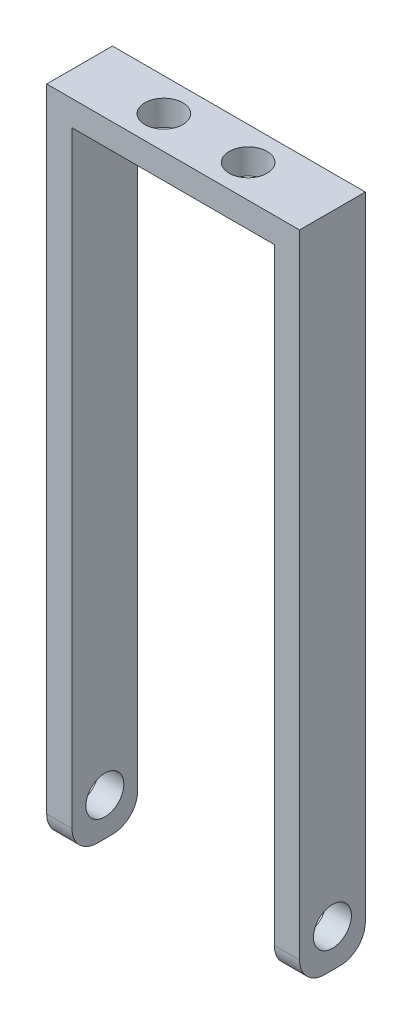
ISO-10303-21;
HEADER;
FILE_DESCRIPTION(('STEP AP214'),'2;1');
FILE_NAME('part.step','',(''),(''),'','','');
FILE_SCHEMA(('AUTOMOTIVE_DESIGN { 1 0 10303 214 1 1 1 1 }'));
ENDSEC;
DATA;
#1=APPLICATION_CONTEXT('core data for automotive mechanical design processes');
#2=APPLICATION_PROTOCOL_DEFINITION('international standard','automotive_design',2000,#1);
#3=PRODUCT_CONTEXT('',#1,'mechanical');
#4=PRODUCT('Part','Part','',(#3));
#5=PRODUCT_RELATED_PRODUCT_CATEGORY('part','',(#4));
#6=PRODUCT_DEFINITION_FORMATION('','',#4);
#7=PRODUCT_DEFINITION_CONTEXT('part definition',#1,'design');
#8=PRODUCT_DEFINITION('design','',#6,#7);
#9=PRODUCT_DEFINITION_SHAPE('','',#8);
#10=(LENGTH_UNIT() NAMED_UNIT(*) SI_UNIT(.MILLI.,.METRE.));
#11=(NAMED_UNIT(*) PLANE_ANGLE_UNIT() SI_UNIT($,.RADIAN.));
#12=(NAMED_UNIT(*) SI_UNIT($,.STERADIAN.) SOLID_ANGLE_UNIT());
#13=UNCERTAINTY_MEASURE_WITH_UNIT(LENGTH_MEASURE(1.E-05),#10,'distance_accuracy_value','');
#14=(GEOMETRIC_REPRESENTATION_CONTEXT(3) GLOBAL_UNCERTAINTY_ASSIGNED_CONTEXT((#13)) GLOBAL_UNIT_ASSIGNED_CONTEXT((#10,
#11,#12)) REPRESENTATION_CONTEXT('',''));
#15=CARTESIAN_POINT('',(0.,0.,0.));
#16=DIRECTION('',(0.,0.,1.));
#17=DIRECTION('',(1.,0.,0.));
#18=AXIS2_PLACEMENT_3D('',#15,#16,#17);
#19=CARTESIAN_POINT('',(0.,-3.,0.));
#20=DIRECTION('',(0.,-1.,0.));
#21=DIRECTION('',(0.,0.,-1.));
#22=AXIS2_PLACEMENT_3D('',#19,#20,#21);
#23=PLANE('',#22);
#24=CARTESIAN_POINT('',(-5.,-3.,0.));
#25=DIRECTION('',(0.,-1.,0.));
#26=DIRECTION('',(0.,0.,-1.));
#27=AXIS2_PLACEMENT_3D('',#24,#25,#26);
#28=CIRCLE('',#27,2.25);
#29=CARTESIAN_POINT('',(-5.,-3.,-2.25));
#30=VERTEX_POINT('',#29);
#31=EDGE_CURVE('E415',#30,#30,#28,.F.);
#32=ORIENTED_EDGE('',*,*,#31,.T.);
#33=EDGE_LOOP('',(#32));
#34=FACE_BOUND('',#33,.T.);
#35=CARTESIAN_POINT('',(5.,-3.,0.));
#36=DIRECTION('',(0.,-1.,0.));
#37=DIRECTION('',(0.,0.,-1.));
#38=AXIS2_PLACEMENT_3D('',#35,#36,#37);
#39=CIRCLE('',#38,2.25);
#40=CARTESIAN_POINT('',(5.,-3.,-2.25));
#41=VERTEX_POINT('',#40);
#42=EDGE_CURVE('E426',#41,#41,#39,.F.);
#43=ORIENTED_EDGE('',*,*,#42,.T.);
#44=EDGE_LOOP('',(#43));
#45=FACE_BOUND('',#44,.T.);
#46=DIRECTION('',(-1.,0.,0.));
#47=VECTOR('',#46,1.);
#48=CARTESIAN_POINT('',(-15.,-3.,-3.9));
#49=LINE('',#48,#47);
#50=CARTESIAN_POINT('',(12.,-3.,-3.9));
#51=VERTEX_POINT('',#50);
#52=CARTESIAN_POINT('',(-12.,-3.,-3.9));
#53=VERTEX_POINT('',#52);
#54=EDGE_CURVE('E134',#51,#53,#49,.T.);
#55=ORIENTED_EDGE('',*,*,#54,.F.);
#56=DIRECTION('',(0.,0.,-1.));
#57=VECTOR('',#56,1.);
#58=CARTESIAN_POINT('',(12.,-3.,3.9));
#59=LINE('',#58,#57);
#60=CARTESIAN_POINT('',(12.,-3.,3.9));
#61=VERTEX_POINT('',#60);
#62=EDGE_CURVE('E122',#61,#51,#59,.T.);
#63=ORIENTED_EDGE('',*,*,#62,.F.);
#64=DIRECTION('',(1.,0.,0.));
#65=VECTOR('',#64,1.);
#66=CARTESIAN_POINT('',(-15.,-3.,3.9));
#67=LINE('',#66,#65);
#68=CARTESIAN_POINT('',(-12.,-3.,3.9));
#69=VERTEX_POINT('',#68);
#70=EDGE_CURVE('E131',#69,#61,#67,.T.);
#71=ORIENTED_EDGE('',*,*,#70,.F.);
#72=DIRECTION('',(0.,0.,1.));
#73=VECTOR('',#72,1.);
#74=CARTESIAN_POINT('',(-12.,-3.,3.9));
#75=LINE('',#74,#73);
#76=EDGE_CURVE('E125',#53,#69,#75,.T.);
#77=ORIENTED_EDGE('',*,*,#76,.F.);
#78=EDGE_LOOP('',(#55,#63,#71,#77));
#79=FACE_BOUND('',#78,.T.);
#80=ADVANCED_FACE('F33',(#34,#45,#79),#23,.T.);
#81=CARTESIAN_POINT('',(15.,-3.,3.9));
#82=DIRECTION('',(1.,0.,0.));
#83=DIRECTION('',(0.,0.,-1.));
#84=AXIS2_PLACEMENT_3D('',#81,#82,#83);
#85=PLANE('',#84);
#86=CARTESIAN_POINT('',(15.,-73.5,0.));
#87=DIRECTION('',(1.,0.,0.));
#88=DIRECTION('',(0.,0.,-1.));
#89=AXIS2_PLACEMENT_3D('',#86,#87,#88);
#90=CIRCLE('',#89,2.25);
#91=CARTESIAN_POINT('',(15.,-73.5,-2.25));
#92=VERTEX_POINT('',#91);
#93=EDGE_CURVE('E136',#92,#92,#90,.T.);
#94=ORIENTED_EDGE('',*,*,#93,.F.);
#95=EDGE_LOOP('',(#94));
#96=FACE_BOUND('',#95,.T.);
#97=DIRECTION('',(0.,0.,1.));
#98=VECTOR('',#97,1.);
#99=CARTESIAN_POINT('',(15.,-78.,3.9));
#100=LINE('',#99,#98);
#101=CARTESIAN_POINT('',(15.,-78.,-0.9));
#102=VERTEX_POINT('',#101);
#103=CARTESIAN_POINT('',(15.,-78.,0.9));
#104=VERTEX_POINT('',#103);
#105=EDGE_CURVE('E135',#102,#104,#100,.T.);
#106=ORIENTED_EDGE('',*,*,#105,.F.);
#107=CARTESIAN_POINT('',(15.,-75.,-0.9));
#108=DIRECTION('',(1.,0.,0.));
#109=DIRECTION('',(0.,0.,-1.));
#110=AXIS2_PLACEMENT_3D('',#107,#108,#109);
#111=CIRCLE('',#110,3.);
#112=CARTESIAN_POINT('',(15.,-75.,-3.9));
#113=VERTEX_POINT('',#112);
#114=EDGE_CURVE('E198',#102,#113,#111,.T.);
#115=ORIENTED_EDGE('',*,*,#114,.T.);
#116=DIRECTION('',(0.,1.,0.));
#117=VECTOR('',#116,1.);
#118=CARTESIAN_POINT('',(15.,-3.,-3.9));
#119=LINE('',#118,#117);
#120=CARTESIAN_POINT('',(15.,0.,-3.9));
#121=VERTEX_POINT('',#120);
#122=EDGE_CURVE('E142',#113,#121,#119,.T.);
#123=ORIENTED_EDGE('',*,*,#122,.T.);
#124=DIRECTION('',(0.,0.,-1.));
#125=VECTOR('',#124,1.);
#126=CARTESIAN_POINT('',(15.,0.,3.9));
#127=LINE('',#126,#125);
#128=CARTESIAN_POINT('',(15.,0.,3.9));
#129=VERTEX_POINT('',#128);
#130=EDGE_CURVE('E150',#129,#121,#127,.T.);
#131=ORIENTED_EDGE('',*,*,#130,.F.);
#132=DIRECTION('',(0.,1.,0.));
#133=VECTOR('',#132,1.);
#134=CARTESIAN_POINT('',(15.,-3.,3.9));
#135=LINE('',#134,#133);
#136=CARTESIAN_POINT('',(15.,-75.,3.9));
#137=VERTEX_POINT('',#136);
#138=EDGE_CURVE('E162',#137,#129,#135,.T.);
#139=ORIENTED_EDGE('',*,*,#138,.F.);
#140=CARTESIAN_POINT('',(15.,-75.,0.9));
#141=DIRECTION('',(1.,0.,0.));
#142=DIRECTION('',(0.,0.,-1.));
#143=AXIS2_PLACEMENT_3D('',#140,#141,#142);
#144=CIRCLE('',#143,3.);
#145=EDGE_CURVE('E196',#137,#104,#144,.T.);
#146=ORIENTED_EDGE('',*,*,#145,.T.);
#147=EDGE_LOOP('',(#106,#115,#123,#131,#139,#146));
#148=FACE_BOUND('',#147,.T.);
#149=ADVANCED_FACE('F217',(#96,#148),#85,.T.);
#150=CARTESIAN_POINT('',(-15.,-3.,3.9));
#151=DIRECTION('',(0.,0.,1.));
#152=DIRECTION('',(1.,0.,0.));
#153=AXIS2_PLACEMENT_3D('',#150,#151,#152);
#154=PLANE('',#153);
#155=DIRECTION('',(0.,1.,0.));
#156=VECTOR('',#155,1.);
#157=CARTESIAN_POINT('',(-15.,-3.,3.9));
#158=LINE('',#157,#156);
#159=CARTESIAN_POINT('',(-15.,-75.,3.9));
#160=VERTEX_POINT('',#159);
#161=CARTESIAN_POINT('',(-15.,0.,3.9));
#162=VERTEX_POINT('',#161);
#163=EDGE_CURVE('E165',#160,#162,#158,.T.);
#164=ORIENTED_EDGE('',*,*,#163,.F.);
#165=DIRECTION('',(-1.,0.,0.));
#166=VECTOR('',#165,1.);
#167=CARTESIAN_POINT('',(-15.,-75.,3.9));
#168=LINE('',#167,#166);
#169=CARTESIAN_POINT('',(-12.,-75.,3.9));
#170=VERTEX_POINT('',#169);
#171=EDGE_CURVE('E11',#160,#170,#168,.F.);
#172=ORIENTED_EDGE('',*,*,#171,.T.);
#173=DIRECTION('',(0.,1.,0.));
#174=VECTOR('',#173,1.);
#175=CARTESIAN_POINT('',(-12.,-78.,3.9));
#176=LINE('',#175,#174);
#177=EDGE_CURVE('E141',#170,#69,#176,.T.);
#178=ORIENTED_EDGE('',*,*,#177,.T.);
#179=ORIENTED_EDGE('',*,*,#70,.T.);
#180=DIRECTION('',(0.,1.,0.));
#181=VECTOR('',#180,1.);
#182=CARTESIAN_POINT('',(12.,-78.,3.9));
#183=LINE('',#182,#181);
#184=CARTESIAN_POINT('',(12.,-75.,3.9));
#185=VERTEX_POINT('',#184);
#186=EDGE_CURVE('E118',#185,#61,#183,.T.);
#187=ORIENTED_EDGE('',*,*,#186,.F.);
#188=DIRECTION('',(-1.,0.,0.));
#189=VECTOR('',#188,1.);
#190=CARTESIAN_POINT('',(15.,-75.,3.9));
#191=LINE('',#190,#189);
#192=EDGE_CURVE('E41',#185,#137,#191,.F.);
#193=ORIENTED_EDGE('',*,*,#192,.T.);
#194=ORIENTED_EDGE('',*,*,#138,.T.);
#195=DIRECTION('',(1.,0.,0.));
#196=VECTOR('',#195,1.);
#197=CARTESIAN_POINT('',(-15.,0.,3.9));
#198=LINE('',#197,#196);
#199=EDGE_CURVE('E146',#162,#129,#198,.T.);
#200=ORIENTED_EDGE('',*,*,#199,.F.);
#201=EDGE_LOOP('',(#164,#172,#178,#179,#187,#193,#194,#200));
#202=FACE_BOUND('',#201,.T.);
#203=ADVANCED_FACE('F139',(#202),#154,.T.);
#204=CARTESIAN_POINT('',(-15.,-3.,3.9));
#205=DIRECTION('',(-1.,0.,0.));
#206=DIRECTION('',(0.,0.,1.));
#207=AXIS2_PLACEMENT_3D('',#204,#205,#206);
#208=PLANE('',#207);
#209=CARTESIAN_POINT('',(-15.,-73.5,0.));
#210=DIRECTION('',(1.,0.,0.));
#211=DIRECTION('',(0.,0.,-1.));
#212=AXIS2_PLACEMENT_3D('',#209,#210,#211);
#213=CIRCLE('',#212,2.25);
#214=CARTESIAN_POINT('',(-15.,-73.5,-2.25));
#215=VERTEX_POINT('',#214);
#216=EDGE_CURVE('E172',#215,#215,#213,.T.);
#217=ORIENTED_EDGE('',*,*,#216,.T.);
#218=EDGE_LOOP('',(#217));
#219=FACE_BOUND('',#218,.T.);
#220=DIRECTION('',(0.,1.,0.));
#221=VECTOR('',#220,1.);
#222=CARTESIAN_POINT('',(-15.,-3.,-3.9));
#223=LINE('',#222,#221);
#224=CARTESIAN_POINT('',(-15.,-75.,-3.9));
#225=VERTEX_POINT('',#224);
#226=CARTESIAN_POINT('',(-15.,0.,-3.9));
#227=VERTEX_POINT('',#226);
#228=EDGE_CURVE('E144',#225,#227,#223,.T.);
#229=ORIENTED_EDGE('',*,*,#228,.F.);
#230=CARTESIAN_POINT('',(-15.,-75.,-0.9));
#231=DIRECTION('',(-1.,0.,0.));
#232=DIRECTION('',(0.,0.,1.));
#233=AXIS2_PLACEMENT_3D('',#230,#231,#232);
#234=CIRCLE('',#233,3.);
#235=CARTESIAN_POINT('',(-15.,-78.,-0.9));
#236=VERTEX_POINT('',#235);
#237=EDGE_CURVE('E188',#225,#236,#234,.T.);
#238=ORIENTED_EDGE('',*,*,#237,.T.);
#239=DIRECTION('',(0.,0.,-1.));
#240=VECTOR('',#239,1.);
#241=CARTESIAN_POINT('',(-15.,-78.,3.9));
#242=LINE('',#241,#240);
#243=CARTESIAN_POINT('',(-15.,-78.,0.9));
#244=VERTEX_POINT('',#243);
#245=EDGE_CURVE('E432',#244,#236,#242,.T.);
#246=ORIENTED_EDGE('',*,*,#245,.F.);
#247=CARTESIAN_POINT('',(-15.,-75.,0.9));
#248=DIRECTION('',(-1.,0.,0.));
#249=DIRECTION('',(0.,0.,1.));
#250=AXIS2_PLACEMENT_3D('',#247,#248,#249);
#251=CIRCLE('',#250,3.);
#252=EDGE_CURVE('E186',#244,#160,#251,.T.);
#253=ORIENTED_EDGE('',*,*,#252,.T.);
#254=ORIENTED_EDGE('',*,*,#163,.T.);
#255=DIRECTION('',(0.,0.,1.));
#256=VECTOR('',#255,1.);
#257=CARTESIAN_POINT('',(-15.,0.,3.9));
#258=LINE('',#257,#256);
#259=EDGE_CURVE('E157',#227,#162,#258,.T.);
#260=ORIENTED_EDGE('',*,*,#259,.F.);
#261=EDGE_LOOP('',(#229,#238,#246,#253,#254,#260));
#262=FACE_BOUND('',#261,.T.);
#263=ADVANCED_FACE('F255',(#219,#262),#208,.T.);
#264=CARTESIAN_POINT('',(-15.,-3.,-3.9));
#265=DIRECTION('',(0.,0.,-1.));
#266=DIRECTION('',(-1.,0.,0.));
#267=AXIS2_PLACEMENT_3D('',#264,#265,#266);
#268=PLANE('',#267);
#269=DIRECTION('',(0.,1.,0.));
#270=VECTOR('',#269,1.);
#271=CARTESIAN_POINT('',(-12.,-78.,-3.9));
#272=LINE('',#271,#270);
#273=CARTESIAN_POINT('',(-12.,-75.,-3.9));
#274=VERTEX_POINT('',#273);
#275=EDGE_CURVE('E422',#274,#53,#272,.T.);
#276=ORIENTED_EDGE('',*,*,#275,.F.);
#277=DIRECTION('',(1.,0.,0.));
#278=VECTOR('',#277,1.);
#279=CARTESIAN_POINT('',(-15.,-75.,-3.9));
#280=LINE('',#279,#278);
#281=EDGE_CURVE('E184',#274,#225,#280,.F.);
#282=ORIENTED_EDGE('',*,*,#281,.T.);
#283=ORIENTED_EDGE('',*,*,#228,.T.);
#284=DIRECTION('',(-1.,0.,0.));
#285=VECTOR('',#284,1.);
#286=CARTESIAN_POINT('',(-15.,0.,-3.9));
#287=LINE('',#286,#285);
#288=EDGE_CURVE('E153',#121,#227,#287,.T.);
#289=ORIENTED_EDGE('',*,*,#288,.F.);
#290=ORIENTED_EDGE('',*,*,#122,.F.);
#291=DIRECTION('',(1.,0.,0.));
#292=VECTOR('',#291,1.);
#293=CARTESIAN_POINT('',(12.,-75.,-3.9));
#294=LINE('',#293,#292);
#295=CARTESIAN_POINT('',(12.,-75.,-3.9));
#296=VERTEX_POINT('',#295);
#297=EDGE_CURVE('E182',#113,#296,#294,.F.);
#298=ORIENTED_EDGE('',*,*,#297,.T.);
#299=DIRECTION('',(0.,1.,0.));
#300=VECTOR('',#299,1.);
#301=CARTESIAN_POINT('',(12.,-78.,-3.9));
#302=LINE('',#301,#300);
#303=EDGE_CURVE('E126',#296,#51,#302,.T.);
#304=ORIENTED_EDGE('',*,*,#303,.T.);
#305=ORIENTED_EDGE('',*,*,#54,.T.);
#306=EDGE_LOOP('',(#276,#282,#283,#289,#290,#298,#304,#305));
#307=FACE_BOUND('',#306,.T.);
#308=ADVANCED_FACE('F222',(#307),#268,.T.);
#309=CARTESIAN_POINT('',(0.,0.,0.));
#310=DIRECTION('',(0.,-1.,0.));
#311=DIRECTION('',(0.,0.,-1.));
#312=AXIS2_PLACEMENT_3D('',#309,#310,#311);
#313=PLANE('',#312);
#314=CARTESIAN_POINT('',(-5.,0.,0.));
#315=DIRECTION('',(0.,1.,0.));
#316=DIRECTION('',(0.,0.,1.));
#317=AXIS2_PLACEMENT_3D('',#314,#315,#316);
#318=CIRCLE('',#317,2.25);
#319=CARTESIAN_POINT('',(-5.,0.,2.25));
#320=VERTEX_POINT('',#319);
#321=EDGE_CURVE('E154',#320,#320,#318,.T.);
#322=ORIENTED_EDGE('',*,*,#321,.F.);
#323=EDGE_LOOP('',(#322));
#324=FACE_BOUND('',#323,.T.);
#325=CARTESIAN_POINT('',(5.,0.,0.));
#326=DIRECTION('',(0.,1.,0.));
#327=DIRECTION('',(0.,0.,1.));
#328=AXIS2_PLACEMENT_3D('',#325,#326,#327);
#329=CIRCLE('',#328,2.25);
#330=CARTESIAN_POINT('',(5.,0.,2.25));
#331=VERTEX_POINT('',#330);
#332=EDGE_CURVE('E419',#331,#331,#329,.T.);
#333=ORIENTED_EDGE('',*,*,#332,.F.);
#334=EDGE_LOOP('',(#333));
#335=FACE_BOUND('',#334,.T.);
#336=ORIENTED_EDGE('',*,*,#130,.T.);
#337=ORIENTED_EDGE('',*,*,#288,.T.);
#338=ORIENTED_EDGE('',*,*,#259,.T.);
#339=ORIENTED_EDGE('',*,*,#199,.T.);
#340=EDGE_LOOP('',(#336,#337,#338,#339));
#341=FACE_BOUND('',#340,.T.);
#342=ADVANCED_FACE('F226',(#324,#335,#341),#313,.F.);
#343=CARTESIAN_POINT('',(5.,-3.001,0.));
#344=DIRECTION('',(0.,1.,0.));
#345=DIRECTION('',(0.,0.,1.));
#346=AXIS2_PLACEMENT_3D('',#343,#344,#345);
#347=CYLINDRICAL_SURFACE('',#346,2.25);
#348=ORIENTED_EDGE('',*,*,#42,.F.);
#349=EDGE_LOOP('',(#348));
#350=FACE_BOUND('',#349,.T.);
#351=ORIENTED_EDGE('',*,*,#332,.T.);
#352=EDGE_LOOP('',(#351));
#353=FACE_BOUND('',#352,.T.);
#354=ADVANCED_FACE('F248',(#350,#353),#347,.F.);
#355=CARTESIAN_POINT('',(-5.,-3.001,0.));
#356=DIRECTION('',(0.,1.,0.));
#357=DIRECTION('',(0.,0.,1.));
#358=AXIS2_PLACEMENT_3D('',#355,#356,#357);
#359=CYLINDRICAL_SURFACE('',#358,2.25);
#360=ORIENTED_EDGE('',*,*,#31,.F.);
#361=EDGE_LOOP('',(#360));
#362=FACE_BOUND('',#361,.T.);
#363=ORIENTED_EDGE('',*,*,#321,.T.);
#364=EDGE_LOOP('',(#363));
#365=FACE_BOUND('',#364,.T.);
#366=ADVANCED_FACE('F337',(#362,#365),#359,.F.);
#367=CARTESIAN_POINT('',(-12.,-78.,3.9));
#368=DIRECTION('',(-1.,0.,0.));
#369=DIRECTION('',(0.,0.,1.));
#370=AXIS2_PLACEMENT_3D('',#367,#368,#369);
#371=PLANE('',#370);
#372=CARTESIAN_POINT('',(-12.,-73.5,0.));
#373=DIRECTION('',(-1.,0.,0.));
#374=DIRECTION('',(0.,0.,1.));
#375=AXIS2_PLACEMENT_3D('',#372,#373,#374);
#376=CIRCLE('',#375,2.25);
#377=CARTESIAN_POINT('',(-12.,-73.5,2.25));
#378=VERTEX_POINT('',#377);
#379=EDGE_CURVE('E171',#378,#378,#376,.T.);
#380=ORIENTED_EDGE('',*,*,#379,.T.);
#381=EDGE_LOOP('',(#380));
#382=FACE_BOUND('',#381,.T.);
#383=DIRECTION('',(0.,0.,1.));
#384=VECTOR('',#383,1.);
#385=CARTESIAN_POINT('',(-12.,-78.,3.9));
#386=LINE('',#385,#384);
#387=CARTESIAN_POINT('',(-12.,-78.,-0.9));
#388=VERTEX_POINT('',#387);
#389=CARTESIAN_POINT('',(-12.,-78.,0.9));
#390=VERTEX_POINT('',#389);
#391=EDGE_CURVE('E430',#388,#390,#386,.T.);
#392=ORIENTED_EDGE('',*,*,#391,.F.);
#393=CARTESIAN_POINT('',(-12.,-75.,-0.9));
#394=DIRECTION('',(-1.,0.,0.));
#395=DIRECTION('',(0.,0.,1.));
#396=AXIS2_PLACEMENT_3D('',#393,#394,#395);
#397=CIRCLE('',#396,3.);
#398=EDGE_CURVE('E180',#388,#274,#397,.F.);
#399=ORIENTED_EDGE('',*,*,#398,.T.);
#400=ORIENTED_EDGE('',*,*,#275,.T.);
#401=ORIENTED_EDGE('',*,*,#76,.T.);
#402=ORIENTED_EDGE('',*,*,#177,.F.);
#403=CARTESIAN_POINT('',(-12.,-75.,0.9));
#404=DIRECTION('',(-1.,0.,0.));
#405=DIRECTION('',(0.,0.,1.));
#406=AXIS2_PLACEMENT_3D('',#403,#404,#405);
#407=CIRCLE('',#406,3.);
#408=EDGE_CURVE('E178',#170,#390,#407,.F.);
#409=ORIENTED_EDGE('',*,*,#408,.T.);
#410=EDGE_LOOP('',(#392,#399,#400,#401,#402,#409));
#411=FACE_BOUND('',#410,.T.);
#412=ADVANCED_FACE('F328',(#382,#411),#371,.F.);
#413=CARTESIAN_POINT('',(0.,-78.,0.));
#414=DIRECTION('',(0.,-1.,0.));
#415=DIRECTION('',(0.,0.,-1.));
#416=AXIS2_PLACEMENT_3D('',#413,#414,#415);
#417=PLANE('',#416);
#418=ORIENTED_EDGE('',*,*,#245,.T.);
#419=DIRECTION('',(1.,0.,0.));
#420=VECTOR('',#419,1.);
#421=CARTESIAN_POINT('',(0.,-78.,-0.9));
#422=LINE('',#421,#420);
#423=EDGE_CURVE('E175',#236,#388,#422,.T.);
#424=ORIENTED_EDGE('',*,*,#423,.T.);
#425=ORIENTED_EDGE('',*,*,#391,.T.);
#426=DIRECTION('',(-1.,0.,0.));
#427=VECTOR('',#426,1.);
#428=CARTESIAN_POINT('',(0.,-78.,0.9));
#429=LINE('',#428,#427);
#430=EDGE_CURVE('E164',#390,#244,#429,.T.);
#431=ORIENTED_EDGE('',*,*,#430,.T.);
#432=EDGE_LOOP('',(#418,#424,#425,#431));
#433=FACE_BOUND('',#432,.T.);
#434=ADVANCED_FACE('F319',(#433),#417,.T.);
#435=CARTESIAN_POINT('',(12.,-78.,3.9));
#436=DIRECTION('',(1.,0.,0.));
#437=DIRECTION('',(0.,0.,-1.));
#438=AXIS2_PLACEMENT_3D('',#435,#436,#437);
#439=PLANE('',#438);
#440=CARTESIAN_POINT('',(12.,-73.5,0.));
#441=DIRECTION('',(1.,0.,0.));
#442=DIRECTION('',(0.,0.,-1.));
#443=AXIS2_PLACEMENT_3D('',#440,#441,#442);
#444=CIRCLE('',#443,2.25);
#445=CARTESIAN_POINT('',(12.,-73.5,-2.25));
#446=VERTEX_POINT('',#445);
#447=EDGE_CURVE('E168',#446,#446,#444,.T.);
#448=ORIENTED_EDGE('',*,*,#447,.T.);
#449=EDGE_LOOP('',(#448));
#450=FACE_BOUND('',#449,.T.);
#451=ORIENTED_EDGE('',*,*,#303,.F.);
#452=CARTESIAN_POINT('',(12.,-75.,-0.9));
#453=DIRECTION('',(1.,0.,0.));
#454=DIRECTION('',(0.,0.,-1.));
#455=AXIS2_PLACEMENT_3D('',#452,#453,#454);
#456=CIRCLE('',#455,3.);
#457=CARTESIAN_POINT('',(12.,-78.,-0.9));
#458=VERTEX_POINT('',#457);
#459=EDGE_CURVE('E201',#296,#458,#456,.F.);
#460=ORIENTED_EDGE('',*,*,#459,.T.);
#461=DIRECTION('',(0.,0.,-1.));
#462=VECTOR('',#461,1.);
#463=CARTESIAN_POINT('',(12.,-78.,3.9));
#464=LINE('',#463,#462);
#465=CARTESIAN_POINT('',(12.,-78.,0.9));
#466=VERTEX_POINT('',#465);
#467=EDGE_CURVE('E204',#466,#458,#464,.T.);
#468=ORIENTED_EDGE('',*,*,#467,.F.);
#469=CARTESIAN_POINT('',(12.,-75.,0.9));
#470=DIRECTION('',(1.,0.,0.));
#471=DIRECTION('',(0.,0.,-1.));
#472=AXIS2_PLACEMENT_3D('',#469,#470,#471);
#473=CIRCLE('',#472,3.);
#474=EDGE_CURVE('E48',#466,#185,#473,.F.);
#475=ORIENTED_EDGE('',*,*,#474,.T.);
#476=ORIENTED_EDGE('',*,*,#186,.T.);
#477=ORIENTED_EDGE('',*,*,#62,.T.);
#478=EDGE_LOOP('',(#451,#460,#468,#475,#476,#477));
#479=FACE_BOUND('',#478,.T.);
#480=ADVANCED_FACE('F121',(#450,#479),#439,.F.);
#481=CARTESIAN_POINT('',(0.,-78.,0.));
#482=DIRECTION('',(0.,1.,0.));
#483=DIRECTION('',(0.,0.,1.));
#484=AXIS2_PLACEMENT_3D('',#481,#482,#483);
#485=PLANE('',#484);
#486=ORIENTED_EDGE('',*,*,#467,.T.);
#487=DIRECTION('',(1.,0.,0.));
#488=VECTOR('',#487,1.);
#489=CARTESIAN_POINT('',(15.,-78.,-0.9));
#490=LINE('',#489,#488);
#491=EDGE_CURVE('E193',#458,#102,#490,.T.);
#492=ORIENTED_EDGE('',*,*,#491,.T.);
#493=ORIENTED_EDGE('',*,*,#105,.T.);
#494=DIRECTION('',(-1.,0.,0.));
#495=VECTOR('',#494,1.);
#496=CARTESIAN_POINT('',(12.,-78.,0.9));
#497=LINE('',#496,#495);
#498=EDGE_CURVE('E190',#104,#466,#497,.T.);
#499=ORIENTED_EDGE('',*,*,#498,.T.);
#500=EDGE_LOOP('',(#486,#492,#493,#499));
#501=FACE_BOUND('',#500,.T.);
#502=ADVANCED_FACE('F209',(#501),#485,.F.);
#503=CARTESIAN_POINT('',(-15.,-73.5,0.));
#504=DIRECTION('',(1.,0.,0.));
#505=DIRECTION('',(0.,0.,-1.));
#506=AXIS2_PLACEMENT_3D('',#503,#504,#505);
#507=CYLINDRICAL_SURFACE('',#506,2.25);
#508=ORIENTED_EDGE('',*,*,#93,.T.);
#509=EDGE_LOOP('',(#508));
#510=FACE_BOUND('',#509,.T.);
#511=ORIENTED_EDGE('',*,*,#447,.F.);
#512=EDGE_LOOP('',(#511));
#513=FACE_BOUND('',#512,.T.);
#514=ADVANCED_FACE('F296',(#510,#513),#507,.F.);
#515=ORIENTED_EDGE('',*,*,#216,.F.);
#516=EDGE_LOOP('',(#515));
#517=FACE_BOUND('',#516,.T.);
#518=ORIENTED_EDGE('',*,*,#379,.F.);
#519=EDGE_LOOP('',(#518));
#520=FACE_BOUND('',#519,.T.);
#521=ADVANCED_FACE('F264',(#517,#520),#507,.F.);
#522=CARTESIAN_POINT('',(0.,-75.,-0.9));
#523=DIRECTION('',(1.,0.,0.));
#524=DIRECTION('',(0.,0.,-1.));
#525=AXIS2_PLACEMENT_3D('',#522,#523,#524);
#526=CYLINDRICAL_SURFACE('',#525,3.);
#527=ORIENTED_EDGE('',*,*,#237,.F.);
#528=ORIENTED_EDGE('',*,*,#281,.F.);
#529=ORIENTED_EDGE('',*,*,#398,.F.);
#530=ORIENTED_EDGE('',*,*,#423,.F.);
#531=EDGE_LOOP('',(#527,#528,#529,#530));
#532=FACE_BOUND('',#531,.T.);
#533=ADVANCED_FACE('F261',(#532),#526,.T.);
#534=CARTESIAN_POINT('',(0.,-75.,-0.9));
#535=DIRECTION('',(-1.,0.,0.));
#536=DIRECTION('',(0.,0.,1.));
#537=AXIS2_PLACEMENT_3D('',#534,#535,#536);
#538=CYLINDRICAL_SURFACE('',#537,3.);
#539=ORIENTED_EDGE('',*,*,#459,.F.);
#540=ORIENTED_EDGE('',*,*,#297,.F.);
#541=ORIENTED_EDGE('',*,*,#114,.F.);
#542=ORIENTED_EDGE('',*,*,#491,.F.);
#543=EDGE_LOOP('',(#539,#540,#541,#542));
#544=FACE_BOUND('',#543,.T.);
#545=ADVANCED_FACE('F214',(#544),#538,.T.);
#546=CARTESIAN_POINT('',(0.,-75.,0.9));
#547=DIRECTION('',(-1.,0.,0.));
#548=DIRECTION('',(0.,0.,1.));
#549=AXIS2_PLACEMENT_3D('',#546,#547,#548);
#550=CYLINDRICAL_SURFACE('',#549,3.);
#551=ORIENTED_EDGE('',*,*,#408,.F.);
#552=ORIENTED_EDGE('',*,*,#171,.F.);
#553=ORIENTED_EDGE('',*,*,#252,.F.);
#554=ORIENTED_EDGE('',*,*,#430,.F.);
#555=EDGE_LOOP('',(#551,#552,#553,#554));
#556=FACE_BOUND('',#555,.T.);
#557=ADVANCED_FACE('F231',(#556),#550,.T.);
#558=CARTESIAN_POINT('',(0.,-75.,0.9));
#559=DIRECTION('',(1.,0.,0.));
#560=DIRECTION('',(0.,0.,-1.));
#561=AXIS2_PLACEMENT_3D('',#558,#559,#560);
#562=CYLINDRICAL_SURFACE('',#561,3.);
#563=ORIENTED_EDGE('',*,*,#145,.F.);
#564=ORIENTED_EDGE('',*,*,#192,.F.);
#565=ORIENTED_EDGE('',*,*,#474,.F.);
#566=ORIENTED_EDGE('',*,*,#498,.F.);
#567=EDGE_LOOP('',(#563,#564,#565,#566));
#568=FACE_BOUND('',#567,.T.);
#569=ADVANCED_FACE('F35',(#568),#562,.T.);
#570=CLOSED_SHELL('',(#80,#149,#203,#263,#308,#342,#354,#366,#412,#434,#480,#502,#514,#521,#533,
#545,#557,#569));
#571=MANIFOLD_SOLID_BREP('B2',#570);
#572=ADVANCED_BREP_SHAPE_REPRESENTATION('',(#18,#571),#14);
#573=SHAPE_DEFINITION_REPRESENTATION(#9,#572);
ENDSEC;
END-ISO-10303-21;
